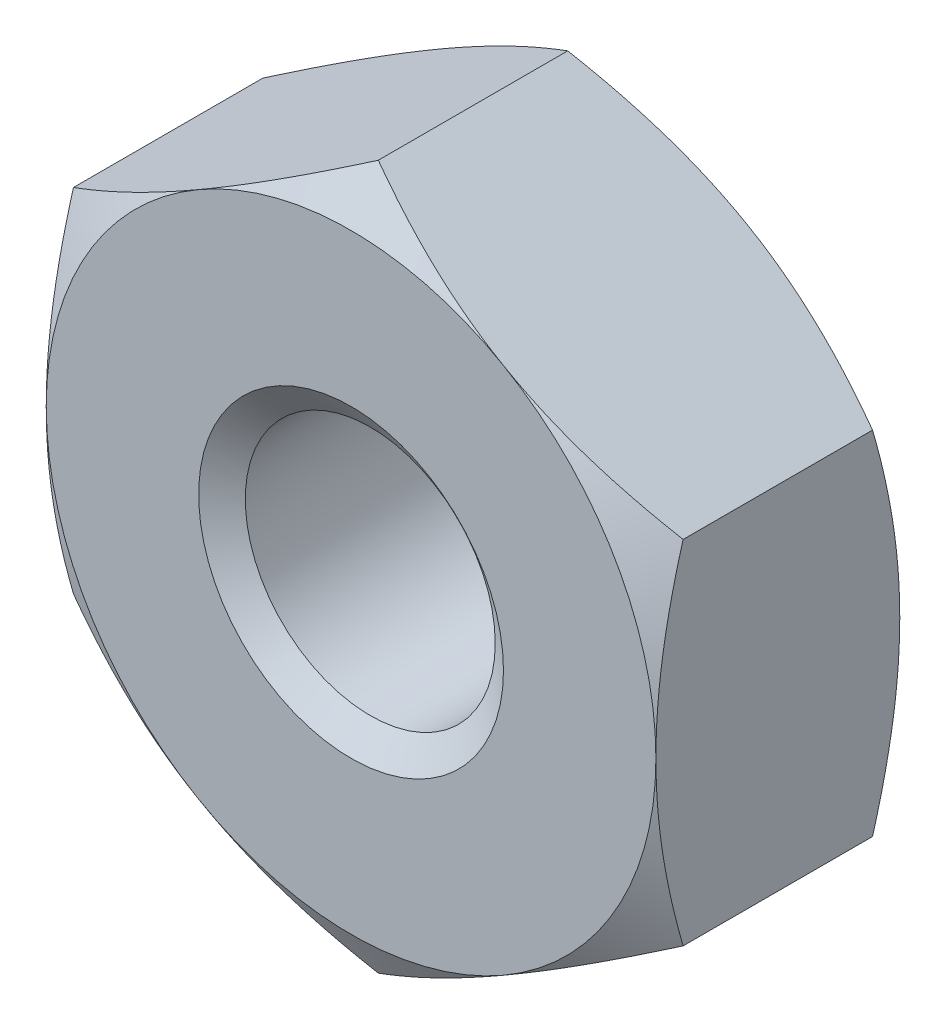
ISO-10303-21;
HEADER;
FILE_DESCRIPTION(('STEP AP214'),'2;1');
FILE_NAME('part.step','',(''),(''),'','','');
FILE_SCHEMA(('AUTOMOTIVE_DESIGN { 1 0 10303 214 1 1 1 1 }'));
ENDSEC;
DATA;
#1=APPLICATION_CONTEXT('core data for automotive mechanical design processes');
#2=APPLICATION_PROTOCOL_DEFINITION('international standard','automotive_design',2000,#1);
#3=PRODUCT_CONTEXT('',#1,'mechanical');
#4=PRODUCT('Part','Part','',(#3));
#5=PRODUCT_RELATED_PRODUCT_CATEGORY('part','',(#4));
#6=PRODUCT_DEFINITION_FORMATION('','',#4);
#7=PRODUCT_DEFINITION_CONTEXT('part definition',#1,'design');
#8=PRODUCT_DEFINITION('design','',#6,#7);
#9=PRODUCT_DEFINITION_SHAPE('','',#8);
#10=(LENGTH_UNIT() NAMED_UNIT(*) SI_UNIT(.MILLI.,.METRE.));
#11=(NAMED_UNIT(*) PLANE_ANGLE_UNIT() SI_UNIT($,.RADIAN.));
#12=(NAMED_UNIT(*) SI_UNIT($,.STERADIAN.) SOLID_ANGLE_UNIT());
#13=UNCERTAINTY_MEASURE_WITH_UNIT(LENGTH_MEASURE(1.E-05),#10,'distance_accuracy_value','');
#14=(GEOMETRIC_REPRESENTATION_CONTEXT(3) GLOBAL_UNCERTAINTY_ASSIGNED_CONTEXT((#13)) GLOBAL_UNIT_ASSIGNED_CONTEXT((#10,
#11,#12)) REPRESENTATION_CONTEXT('',''));
#15=CARTESIAN_POINT('',(0.,0.,0.));
#16=DIRECTION('',(0.,0.,1.));
#17=DIRECTION('',(1.,0.,0.));
#18=AXIS2_PLACEMENT_3D('',#15,#16,#17);
#19=CARTESIAN_POINT('',(0.,0.,-2.));
#20=DIRECTION('',(0.,0.,1.));
#21=DIRECTION('',(1.,0.,0.));
#22=AXIS2_PLACEMENT_3D('',#19,#20,#21);
#23=CYLINDRICAL_SURFACE('',#22,1.025);
#24=CARTESIAN_POINT('',(0.,0.,-0.157546696097181));
#25=DIRECTION('',(0.,0.,1.));
#26=DIRECTION('',(1.,0.,0.));
#27=AXIS2_PLACEMENT_3D('',#24,#25,#26);
#28=CIRCLE('',#27,1.025);
#29=CARTESIAN_POINT('',(1.025,0.,-0.157546696097181));
#30=VERTEX_POINT('',#29);
#31=EDGE_CURVE('E174',#30,#30,#28,.F.);
#32=ORIENTED_EDGE('',*,*,#31,.F.);
#33=EDGE_LOOP('',(#32));
#34=FACE_BOUND('',#33,.T.);
#35=CARTESIAN_POINT('',(0.,0.,-1.81705330390281));
#36=DIRECTION('',(0.,0.,-1.));
#37=DIRECTION('',(-1.,0.,0.));
#38=AXIS2_PLACEMENT_3D('',#35,#36,#37);
#39=CIRCLE('',#38,1.025);
#40=CARTESIAN_POINT('',(-1.025,0.,-1.81705330390281));
#41=VERTEX_POINT('',#40);
#42=EDGE_CURVE('E39',#41,#41,#39,.F.);
#43=ORIENTED_EDGE('',*,*,#42,.F.);
#44=EDGE_LOOP('',(#43));
#45=FACE_BOUND('',#44,.T.);
#46=ADVANCED_FACE('F34',(#34,#45),#23,.F.);
#47=CARTESIAN_POINT('',(0.,2.88675134594815,-2.));
#48=DIRECTION('',(0.,0.,-1.));
#49=DIRECTION('',(-1.,0.,0.));
#50=AXIS2_PLACEMENT_3D('',#47,#48,#49);
#51=PLANE('',#50);
#52=CARTESIAN_POINT('',(0.,0.,-2.));
#53=DIRECTION('',(0.,0.,-1.));
#54=DIRECTION('',(-1.,0.,0.));
#55=AXIS2_PLACEMENT_3D('',#52,#53,#54);
#56=CIRCLE('',#55,2.5);
#57=CARTESIAN_POINT('',(-2.5,0.,-2.));
#58=VERTEX_POINT('',#57);
#59=CARTESIAN_POINT('',(-1.24999999999998,-2.16506350946111,-2.));
#60=VERTEX_POINT('',#59);
#61=EDGE_CURVE('E170',#58,#60,#56,.F.);
#62=ORIENTED_EDGE('',*,*,#61,.F.);
#63=CARTESIAN_POINT('',(-1.25000000000003,2.16506350946108,-2.));
#64=VERTEX_POINT('',#63);
#65=EDGE_CURVE('E152',#64,#58,#56,.F.);
#66=ORIENTED_EDGE('',*,*,#65,.F.);
#67=CARTESIAN_POINT('',(1.25000000000002,2.16506350946108,-2.));
#68=VERTEX_POINT('',#67);
#69=EDGE_CURVE('E169',#68,#64,#56,.F.);
#70=ORIENTED_EDGE('',*,*,#69,.F.);
#71=CARTESIAN_POINT('',(0.,0.,-2.));
#72=DIRECTION('',(0.,0.,1.));
#73=DIRECTION('',(1.,0.,0.));
#74=AXIS2_PLACEMENT_3D('',#71,#72,#73);
#75=CIRCLE('',#74,2.5);
#76=CARTESIAN_POINT('',(2.5,0.,-2.));
#77=VERTEX_POINT('',#76);
#78=EDGE_CURVE('E248',#77,#68,#75,.T.);
#79=ORIENTED_EDGE('',*,*,#78,.F.);
#80=CARTESIAN_POINT('',(1.24999999999998,-2.1650635094611,-2.));
#81=VERTEX_POINT('',#80);
#82=EDGE_CURVE('E364',#81,#77,#56,.F.);
#83=ORIENTED_EDGE('',*,*,#82,.F.);
#84=EDGE_CURVE('E368',#60,#81,#56,.F.);
#85=ORIENTED_EDGE('',*,*,#84,.F.);
#86=EDGE_LOOP('',(#62,#66,#70,#79,#83,#85));
#87=FACE_BOUND('',#86,.T.);
#88=CARTESIAN_POINT('',(0.,0.,-2.));
#89=DIRECTION('',(0.,0.,-1.));
#90=DIRECTION('',(-1.,0.,0.));
#91=AXIS2_PLACEMENT_3D('',#88,#89,#90);
#92=CIRCLE('',#91,1.25);
#93=CARTESIAN_POINT('',(-1.25,0.,-2.));
#94=VERTEX_POINT('',#93);
#95=EDGE_CURVE('E178',#94,#94,#92,.F.);
#96=ORIENTED_EDGE('',*,*,#95,.T.);
#97=EDGE_LOOP('',(#96));
#98=FACE_BOUND('',#97,.T.);
#99=ADVANCED_FACE('F301',(#87,#98),#51,.T.);
#100=CARTESIAN_POINT('',(0.,2.88675134594815,0.));
#101=DIRECTION('',(0.,0.,-1.));
#102=DIRECTION('',(-1.,0.,0.));
#103=AXIS2_PLACEMENT_3D('',#100,#101,#102);
#104=PLANE('',#103);
#105=CARTESIAN_POINT('',(0.,0.,0.));
#106=DIRECTION('',(0.,0.,-1.));
#107=DIRECTION('',(-1.,0.,0.));
#108=AXIS2_PLACEMENT_3D('',#105,#106,#107);
#109=CIRCLE('',#108,2.49999999999999);
#110=CARTESIAN_POINT('',(-2.5,0.,0.));
#111=VERTEX_POINT('',#110);
#112=CARTESIAN_POINT('',(-1.25000000000003,2.16506350946108,0.));
#113=VERTEX_POINT('',#112);
#114=EDGE_CURVE('E11',#111,#113,#109,.T.);
#115=ORIENTED_EDGE('',*,*,#114,.F.);
#116=CARTESIAN_POINT('',(-1.24999999999998,-2.16506350946111,0.));
#117=VERTEX_POINT('',#116);
#118=EDGE_CURVE('E46',#117,#111,#109,.T.);
#119=ORIENTED_EDGE('',*,*,#118,.F.);
#120=CARTESIAN_POINT('',(1.24999999999998,-2.1650635094611,0.));
#121=VERTEX_POINT('',#120);
#122=EDGE_CURVE('E173',#121,#117,#109,.T.);
#123=ORIENTED_EDGE('',*,*,#122,.F.);
#124=CARTESIAN_POINT('',(2.5,0.,0.));
#125=VERTEX_POINT('',#124);
#126=EDGE_CURVE('E355',#125,#121,#109,.T.);
#127=ORIENTED_EDGE('',*,*,#126,.F.);
#128=CARTESIAN_POINT('',(0.,0.,0.));
#129=DIRECTION('',(0.,0.,1.));
#130=DIRECTION('',(1.,0.,0.));
#131=AXIS2_PLACEMENT_3D('',#128,#129,#130);
#132=CIRCLE('',#131,2.5);
#133=CARTESIAN_POINT('',(1.25000000000002,2.16506350946108,0.));
#134=VERTEX_POINT('',#133);
#135=EDGE_CURVE('E128',#125,#134,#132,.T.);
#136=ORIENTED_EDGE('',*,*,#135,.T.);
#137=EDGE_CURVE('E44',#113,#134,#109,.T.);
#138=ORIENTED_EDGE('',*,*,#137,.F.);
#139=EDGE_LOOP('',(#115,#119,#123,#127,#136,#138));
#140=FACE_BOUND('',#139,.T.);
#141=CARTESIAN_POINT('',(0.,0.,0.));
#142=DIRECTION('',(0.,0.,1.));
#143=DIRECTION('',(1.,0.,0.));
#144=AXIS2_PLACEMENT_3D('',#141,#142,#143);
#145=CIRCLE('',#144,1.25);
#146=CARTESIAN_POINT('',(1.25,0.,0.));
#147=VERTEX_POINT('',#146);
#148=EDGE_CURVE('E177',#147,#147,#145,.T.);
#149=ORIENTED_EDGE('',*,*,#148,.F.);
#150=EDGE_LOOP('',(#149));
#151=FACE_BOUND('',#150,.T.);
#152=ADVANCED_FACE('F253',(#140,#151),#104,.F.);
#153=CARTESIAN_POINT('',(0.,2.88675134594815,-2.));
#154=DIRECTION('',(-0.500000000000011,0.866025403784432,0.));
#155=DIRECTION('',(-0.866025403784432,-0.500000000000011,0.));
#156=AXIS2_PLACEMENT_3D('',#153,#154,#155);
#157=PLANE('',#156);
#158=DIRECTION('',(0.,0.,1.));
#159=VECTOR('',#158,1.);
#160=CARTESIAN_POINT('',(-2.5,1.44337567297404,-2.));
#161=LINE('',#160,#159);
#162=CARTESIAN_POINT('',(-2.5,1.44337567297411,-1.77670900630738));
#163=VERTEX_POINT('',#162);
#164=CARTESIAN_POINT('',(-2.5,1.44337567297404,-0.223290993692601));
#165=VERTEX_POINT('',#164);
#166=EDGE_CURVE('E164',#163,#165,#161,.T.);
#167=ORIENTED_EDGE('',*,*,#166,.T.);
#168=CARTESIAN_POINT('',(-2.5002,1.44326020292021,-0.223357664359107));
#169=CARTESIAN_POINT('',(-2.39033676526513,1.50668977106843,-0.186721620107625));
#170=CARTESIAN_POINT('',(-2.27952520010348,1.57066685804383,-0.153402218965056));
#171=CARTESIAN_POINT('',(-2.05598316653395,1.6997289113004,-0.0952422855578579));
#172=CARTESIAN_POINT('',(-1.94324872547162,1.76481617119468,-0.0704223291477388));
#173=CARTESIAN_POINT('',(-1.71917700612474,1.89418403867739,-0.0317856514410534));
#174=CARTESIAN_POINT('',(-1.60787420823263,1.95844473900196,-0.0177117961856408));
#175=CARTESIAN_POINT('',(-1.38474477253168,2.08726857876804,-0.000909152352753178));
#176=CARTESIAN_POINT('',(-1.27291894598578,2.15183124982666,0.00183354879636987));
#177=CARTESIAN_POINT('',(-1.06395802444849,2.27247489412633,-0.00386576000805812));
#178=CARTESIAN_POINT('',(-0.966791682442278,2.32857390783979,-0.010908394381867));
#179=CARTESIAN_POINT('',(-0.773092050289005,2.44040644260542,-0.0332314191249495));
#180=CARTESIAN_POINT('',(-0.676559430340275,2.4961395767184,-0.0485194384402751));
#181=CARTESIAN_POINT('',(-0.482460278259529,2.6082027744217,-0.0867390938444306));
#182=CARTESIAN_POINT('',(-0.384918318217864,2.66451865130904,-0.109832776125529));
#183=CARTESIAN_POINT('',(-0.191289391923917,2.77631036402775,-0.162246656577927));
#184=CARTESIAN_POINT('',(-0.0951999441138252,2.83178763258719,-0.191554535624564));
#185=CARTESIAN_POINT('',(0.000199999999999364,2.88686681600199,-0.223357664359126));
#186=B_SPLINE_CURVE_WITH_KNOTS('',3,(#168,#169,#170,#171,#172,#173,#174,#175,#176,#177,#178,
#179,#180,#181,#182,#183,#184,#185),.UNSPECIFIED.,.F.,.F.,(4,2,2,2,2,2,2,2,4),(0.,
0.396285827362226,0.793524330152049,1.18093086852114,1.56786160134475,1.90479741793733,
2.24204551660464,2.58677531536757,2.93082800105258),.UNSPECIFIED.);
#187=EDGE_CURVE('E133',#165,#113,#186,.T.);
#188=ORIENTED_EDGE('',*,*,#187,.T.);
#189=CARTESIAN_POINT('',(0.,2.88675134594815,-0.223290993692619));
#190=VERTEX_POINT('',#189);
#191=EDGE_CURVE('E53',#113,#190,#186,.T.);
#192=ORIENTED_EDGE('',*,*,#191,.T.);
#193=DIRECTION('',(0.,0.,1.));
#194=VECTOR('',#193,1.);
#195=CARTESIAN_POINT('',(0.,2.88675134594815,-2.));
#196=LINE('',#195,#194);
#197=CARTESIAN_POINT('',(0.,2.88675134594815,-1.77670900630738));
#198=VERTEX_POINT('',#197);
#199=EDGE_CURVE('E149',#198,#190,#196,.T.);
#200=ORIENTED_EDGE('',*,*,#199,.F.);
#201=CARTESIAN_POINT('',(-2.5002,1.44326020292021,-1.77664233564089));
#202=CARTESIAN_POINT('',(-2.39033676526513,1.50668977106843,-1.81327837989238));
#203=CARTESIAN_POINT('',(-2.27952520010348,1.57066685804383,-1.84659778103495));
#204=CARTESIAN_POINT('',(-2.05598316653395,1.6997289113004,-1.90475771444214));
#205=CARTESIAN_POINT('',(-1.94324872547162,1.76481617119468,-1.92957767085226));
#206=CARTESIAN_POINT('',(-1.71917700612474,1.89418403867739,-1.96821434855895));
#207=CARTESIAN_POINT('',(-1.60787420823263,1.95844473900196,-1.98228820381436));
#208=CARTESIAN_POINT('',(-1.38474477253168,2.08726857876804,-1.99909084764725));
#209=CARTESIAN_POINT('',(-1.27291894598578,2.15183124982666,-2.00183354879637));
#210=CARTESIAN_POINT('',(-1.06395802444849,2.27247489412633,-1.99613423999194));
#211=CARTESIAN_POINT('',(-0.966791682442278,2.32857390783979,-1.98909160561813));
#212=CARTESIAN_POINT('',(-0.773092050289005,2.44040644260542,-1.96676858087505));
#213=CARTESIAN_POINT('',(-0.676559430340275,2.4961395767184,-1.95148056155973));
#214=CARTESIAN_POINT('',(-0.482460278259529,2.6082027744217,-1.91326090615557));
#215=CARTESIAN_POINT('',(-0.384918318217864,2.66451865130904,-1.89016722387447));
#216=CARTESIAN_POINT('',(-0.191289391923917,2.77631036402775,-1.83775334342207));
#217=CARTESIAN_POINT('',(-0.0951999441138252,2.83178763258719,-1.80844546437544));
#218=CARTESIAN_POINT('',(0.000199999999999366,2.88686681600199,-1.77664233564088));
#219=B_SPLINE_CURVE_WITH_KNOTS('',3,(#201,#202,#203,#204,#205,#206,#207,#208,#209,#210,#211,
#212,#213,#214,#215,#216,#217,#218),.UNSPECIFIED.,.F.,.F.,(4,2,2,2,2,2,2,2,4),(0.,
0.396285827362226,0.793524330152049,1.18093086852114,1.56786160134475,1.90479741793733,
2.24204551660464,2.58677531536757,2.93082800105258),.UNSPECIFIED.);
#220=EDGE_CURVE('E167',#64,#198,#219,.T.);
#221=ORIENTED_EDGE('',*,*,#220,.F.);
#222=EDGE_CURVE('E263',#163,#64,#219,.T.);
#223=ORIENTED_EDGE('',*,*,#222,.F.);
#224=EDGE_LOOP('',(#167,#188,#192,#200,#221,#223));
#225=FACE_BOUND('',#224,.T.);
#226=ADVANCED_FACE('F36',(#225),#157,.T.);
#227=CARTESIAN_POINT('',(2.5,1.44337567297405,-2.));
#228=DIRECTION('',(0.50000000000001,0.866025403784433,0.));
#229=DIRECTION('',(-0.866025403784433,0.50000000000001,0.));
#230=AXIS2_PLACEMENT_3D('',#227,#228,#229);
#231=PLANE('',#230);
#232=ORIENTED_EDGE('',*,*,#199,.T.);
#233=CARTESIAN_POINT('',(-0.000200000000000814,2.88686681600199,-0.223357664359126));
#234=CARTESIAN_POINT('',(0.10966323473487,2.82343724785376,-0.186721620107642));
#235=CARTESIAN_POINT('',(0.220474799896525,2.75946016087836,-0.15340221896507));
#236=CARTESIAN_POINT('',(0.444016833466049,2.63039810762179,-0.0952422855578697));
#237=CARTESIAN_POINT('',(0.556751274528387,2.56531084772751,-0.0704223291477491));
#238=CARTESIAN_POINT('',(0.780822993875268,2.4359429802448,-0.0317856514410604));
#239=CARTESIAN_POINT('',(0.892125791767376,2.37168227992023,-0.0177117961856461));
#240=CARTESIAN_POINT('',(1.11525522746833,2.24285844015415,-0.000909152352755333));
#241=CARTESIAN_POINT('',(1.22708105401423,2.17829576909553,0.00183354879636898));
#242=CARTESIAN_POINT('',(1.43604197555152,2.05765212479585,-0.00386576000805646));
#243=CARTESIAN_POINT('',(1.53320831755773,2.0015531110824,-0.0109083943818638));
#244=CARTESIAN_POINT('',(1.726907949711,1.88972057631677,-0.0332314191249436));
#245=CARTESIAN_POINT('',(1.82344056965973,1.83398744220379,-0.0485194384402679));
#246=CARTESIAN_POINT('',(2.01753972174048,1.72192424450049,-0.0867390938444206));
#247=CARTESIAN_POINT('',(2.11508168178214,1.66560836761315,-0.109832776125517));
#248=CARTESIAN_POINT('',(2.30871060807608,1.55381665489444,-0.162246656577913));
#249=CARTESIAN_POINT('',(2.40480005588618,1.498339386335,-0.191554535624548));
#250=CARTESIAN_POINT('',(2.5002,1.44326020292021,-0.223357664359108));
#251=B_SPLINE_CURVE_WITH_KNOTS('',3,(#233,#234,#235,#236,#237,#238,#239,#240,#241,#242,#243,
#244,#245,#246,#247,#248,#249,#250),.UNSPECIFIED.,.F.,.F.,(4,2,2,2,2,2,2,2,4),(0.,
0.39628582736223,0.793524330152058,1.18093086852115,1.56786160134477,1.90479741793734,
2.24204551660464,2.58677531536758,2.93082800105258),.UNSPECIFIED.);
#252=EDGE_CURVE('E143',#190,#134,#251,.T.);
#253=ORIENTED_EDGE('',*,*,#252,.T.);
#254=CARTESIAN_POINT('',(2.5,1.44337567297411,-0.223290993692619));
#255=VERTEX_POINT('',#254);
#256=EDGE_CURVE('E60',#134,#255,#251,.T.);
#257=ORIENTED_EDGE('',*,*,#256,.T.);
#258=DIRECTION('',(0.,0.,1.));
#259=VECTOR('',#258,1.);
#260=CARTESIAN_POINT('',(2.5,1.44337567297405,-2.));
#261=LINE('',#260,#259);
#262=CARTESIAN_POINT('',(2.5,1.44337567297411,-1.77670900630738));
#263=VERTEX_POINT('',#262);
#264=EDGE_CURVE('E142',#263,#255,#261,.T.);
#265=ORIENTED_EDGE('',*,*,#264,.F.);
#266=CARTESIAN_POINT('',(-0.000200000000000814,2.88686681600199,-1.77664233564088));
#267=CARTESIAN_POINT('',(0.10966323473487,2.82343724785376,-1.81327837989236));
#268=CARTESIAN_POINT('',(0.220474799896525,2.75946016087836,-1.84659778103493));
#269=CARTESIAN_POINT('',(0.444016833466049,2.63039810762179,-1.90475771444213));
#270=CARTESIAN_POINT('',(0.556751274528387,2.56531084772751,-1.92957767085225));
#271=CARTESIAN_POINT('',(0.780822993875268,2.4359429802448,-1.96821434855894));
#272=CARTESIAN_POINT('',(0.892125791767376,2.37168227992023,-1.98228820381436));
#273=CARTESIAN_POINT('',(1.11525522746833,2.24285844015415,-1.99909084764725));
#274=CARTESIAN_POINT('',(1.22708105401423,2.17829576909553,-2.00183354879637));
#275=CARTESIAN_POINT('',(1.43604197555152,2.05765212479585,-1.99613423999195));
#276=CARTESIAN_POINT('',(1.53320831755773,2.0015531110824,-1.98909160561814));
#277=CARTESIAN_POINT('',(1.726907949711,1.88972057631677,-1.96676858087506));
#278=CARTESIAN_POINT('',(1.82344056965973,1.83398744220379,-1.95148056155973));
#279=CARTESIAN_POINT('',(2.01753972174047,1.72192424450049,-1.91326090615558));
#280=CARTESIAN_POINT('',(2.11508168178214,1.66560836761315,-1.89016722387448));
#281=CARTESIAN_POINT('',(2.30871060807608,1.55381665489444,-1.83775334342209));
#282=CARTESIAN_POINT('',(2.40480005588618,1.498339386335,-1.80844546437545));
#283=CARTESIAN_POINT('',(2.5002,1.44326020292021,-1.77664233564089));
#284=B_SPLINE_CURVE_WITH_KNOTS('',3,(#266,#267,#268,#269,#270,#271,#272,#273,#274,#275,#276,
#277,#278,#279,#280,#281,#282,#283),.UNSPECIFIED.,.F.,.F.,(4,2,2,2,2,2,2,2,4),(0.,
0.39628582736223,0.793524330152058,1.18093086852115,1.56786160134477,1.90479741793734,
2.24204551660464,2.58677531536758,2.93082800105258),.UNSPECIFIED.);
#285=EDGE_CURVE('E257',#68,#263,#284,.T.);
#286=ORIENTED_EDGE('',*,*,#285,.F.);
#287=EDGE_CURVE('E262',#198,#68,#284,.T.);
#288=ORIENTED_EDGE('',*,*,#287,.F.);
#289=EDGE_LOOP('',(#232,#253,#257,#265,#286,#288));
#290=FACE_BOUND('',#289,.T.);
#291=ADVANCED_FACE('F140',(#290),#231,.T.);
#292=CARTESIAN_POINT('',(2.5,1.44337567297405,-2.));
#293=DIRECTION('',(-1.,0.,0.));
#294=DIRECTION('',(0.,0.,1.));
#295=AXIS2_PLACEMENT_3D('',#292,#293,#294);
#296=PLANE('',#295);
#297=CARTESIAN_POINT('',(2.5,-3.82804499372436,-1.19631676327542));
#298=CARTESIAN_POINT('',(2.5,-3.71828085649176,-1.14327266922934));
#299=CARTESIAN_POINT('',(2.5,-3.60825720059557,-1.09075587737965));
#300=CARTESIAN_POINT('',(2.5,-3.38755052986225,-0.987078216748249));
#301=CARTESIAN_POINT('',(2.5,-3.27686740487458,-0.935917582729541));
#302=CARTESIAN_POINT('',(2.5,-3.05410357303962,-0.834984039411619));
#303=CARTESIAN_POINT('',(2.5,-2.94201849305855,-0.785220746914419));
#304=CARTESIAN_POINT('',(2.5,-2.71692709217043,-0.687831615887705));
#305=CARTESIAN_POINT('',(2.5,-2.60392081964714,-0.640205665942532));
#306=CARTESIAN_POINT('',(2.5,-2.37540441715614,-0.547094156496494));
#307=CARTESIAN_POINT('',(2.5,-2.25988058014234,-0.501642052634921));
#308=CARTESIAN_POINT('',(2.5,-2.02747029246858,-0.414297644349653));
#309=CARTESIAN_POINT('',(2.5,-1.91058369184879,-0.37240573597908));
#310=CARTESIAN_POINT('',(2.5,-1.67550198908609,-0.293307342769315));
#311=CARTESIAN_POINT('',(2.5,-1.55731027320533,-0.256090896739911));
#312=CARTESIAN_POINT('',(2.5,-1.3192465914741,-0.187552097840328));
#313=CARTESIAN_POINT('',(2.5,-1.19937516991096,-0.156227881047981));
#314=CARTESIAN_POINT('',(2.5,-0.957870204363777,-0.100994246846285));
#315=CARTESIAN_POINT('',(2.5,-0.836236200197837,-0.0770868037228461));
#316=CARTESIAN_POINT('',(2.5,-0.591501703670372,-0.0382963974514716));
#317=CARTESIAN_POINT('',(2.5,-0.468401210012384,-0.023413442282318));
#318=CARTESIAN_POINT('',(2.5,-0.222157493517489,-0.00398863321840235));
#319=CARTESIAN_POINT('',(2.5,-0.0990195694337815,0.00061868797564693));
#320=CARTESIAN_POINT('',(2.5,0.147170053504644,-0.000752541484249824));
#321=CARTESIAN_POINT('',(2.5,0.270221766445105,-0.00672834425959618));
#322=CARTESIAN_POINT('',(2.5,0.480350397015924,-0.0255492091334953));
#323=CARTESIAN_POINT('',(2.5,0.567659136488612,-0.0359433100274442));
#324=CARTESIAN_POINT('',(2.5,0.741602181646831,-0.0613833814666819));
#325=CARTESIAN_POINT('',(2.5,0.828236378756305,-0.0764300856615279));
#326=CARTESIAN_POINT('',(2.5,1.08705653408103,-0.127759419343891));
#327=CARTESIAN_POINT('',(2.5,1.25802931580448,-0.170218054015717));
#328=CARTESIAN_POINT('',(2.5,1.51386408134074,-0.243447724573246));
#329=CARTESIAN_POINT('',(2.5,1.60005960225958,-0.269821213632266));
#330=CARTESIAN_POINT('',(2.5,1.77155099438373,-0.325177862642344));
#331=CARTESIAN_POINT('',(2.5,1.85684744139719,-0.354159222616812));
#332=CARTESIAN_POINT('',(2.5,2.02618400322709,-0.41412856198767));
#333=CARTESIAN_POINT('',(2.5,2.1102284871677,-0.445104328595928));
#334=CARTESIAN_POINT('',(2.5,2.27766538220567,-0.508873971119178));
#335=CARTESIAN_POINT('',(2.5,2.36105751399613,-0.541668581852094));
#336=CARTESIAN_POINT('',(2.5,2.44414811866673,-0.575193129088608));
#337=B_SPLINE_CURVE_WITH_KNOTS('',3,(#297,#298,#299,#300,#301,#302,#303,#304,#305,#306,#307,
#308,#309,#310,#311,#312,#313,#314,#315,#316,#317,#318,#319,#320,#321,#322,#323,#324,#325,#326,
#327,#328,#329,#330,#331,#332,#333,#334,#335,#336),.UNSPECIFIED.,.F.,.F.,(4,2,2,2,2,2,2,2,2,2,2,
2,2,2,2,2,2,2,2,4),(0.,0.365732370332671,0.731527644124544,1.09941621653744,1.46728558928017,
1.83967125623428,2.21209829506681,2.58371790436001,2.9552197586967,3.32682041917404,
3.69842140819259,4.06764803658774,4.43677881037431,4.70042588015952,4.96411454456776,
5.49188432099894,5.76228301186056,6.03249648197686,6.30118900914356,6.56999089095292),.UNSPECIFIED.);
#338=CARTESIAN_POINT('',(2.50000000000001,-1.44337567297409,-0.223290993692619));
#339=VERTEX_POINT('',#338);
#340=EDGE_CURVE('E135',#339,#125,#337,.T.);
#341=ORIENTED_EDGE('',*,*,#340,.F.);
#342=DIRECTION('',(0.,0.,1.));
#343=VECTOR('',#342,1.);
#344=CARTESIAN_POINT('',(2.5,-1.4433756729741,-2.));
#345=LINE('',#344,#343);
#346=CARTESIAN_POINT('',(2.50000000000001,-1.44337567297409,-1.77670900630738));
#347=VERTEX_POINT('',#346);
#348=EDGE_CURVE('E150',#347,#339,#345,.T.);
#349=ORIENTED_EDGE('',*,*,#348,.F.);
#350=CARTESIAN_POINT('',(2.5,-3.82804499372436,-0.803683236724578));
#351=CARTESIAN_POINT('',(2.5,-3.71828085649176,-0.856727330770667));
#352=CARTESIAN_POINT('',(2.5,-3.60825720059557,-0.909244122620355));
#353=CARTESIAN_POINT('',(2.5,-3.38755052986225,-1.01292178325175));
#354=CARTESIAN_POINT('',(2.5,-3.27686740487458,-1.06408241727046));
#355=CARTESIAN_POINT('',(2.5,-3.05410357303962,-1.16501596058838));
#356=CARTESIAN_POINT('',(2.5,-2.94201849305855,-1.21477925308558));
#357=CARTESIAN_POINT('',(2.5,-2.71692709217043,-1.3121683841123));
#358=CARTESIAN_POINT('',(2.5,-2.60392081964714,-1.35979433405747));
#359=CARTESIAN_POINT('',(2.5,-2.37540441715614,-1.45290584350351));
#360=CARTESIAN_POINT('',(2.5,-2.25988058014234,-1.49835794736508));
#361=CARTESIAN_POINT('',(2.5,-2.02747029246858,-1.58570235565035));
#362=CARTESIAN_POINT('',(2.5,-1.91058369184879,-1.62759426402092));
#363=CARTESIAN_POINT('',(2.5,-1.67550198908609,-1.70669265723069));
#364=CARTESIAN_POINT('',(2.5,-1.55731027320533,-1.74390910326009));
#365=CARTESIAN_POINT('',(2.5,-1.3192465914741,-1.81244790215967));
#366=CARTESIAN_POINT('',(2.5,-1.19937516991096,-1.84377211895202));
#367=CARTESIAN_POINT('',(2.5,-0.957870204363777,-1.89900575315372));
#368=CARTESIAN_POINT('',(2.5,-0.836236200197837,-1.92291319627716));
#369=CARTESIAN_POINT('',(2.5,-0.591501703670372,-1.96170360254853));
#370=CARTESIAN_POINT('',(2.5,-0.468401210012384,-1.97658655771768));
#371=CARTESIAN_POINT('',(2.5,-0.222157493517489,-1.9960113667816));
#372=CARTESIAN_POINT('',(2.5,-0.0990195694337816,-2.00061868797565));
#373=CARTESIAN_POINT('',(2.5,0.147170053504644,-1.99924745851575));
#374=CARTESIAN_POINT('',(2.5,0.270221766445105,-1.99327165574041));
#375=CARTESIAN_POINT('',(2.5,0.480350397015924,-1.97445079086651));
#376=CARTESIAN_POINT('',(2.5,0.567659136488612,-1.96405668997256));
#377=CARTESIAN_POINT('',(2.5,0.741602181646831,-1.93861661853332));
#378=CARTESIAN_POINT('',(2.5,0.828236378756305,-1.92356991433847));
#379=CARTESIAN_POINT('',(2.5,1.08705653408103,-1.87224058065611));
#380=CARTESIAN_POINT('',(2.5,1.25802931580448,-1.82978194598428));
#381=CARTESIAN_POINT('',(2.5,1.51386408134074,-1.75655227542676));
#382=CARTESIAN_POINT('',(2.5,1.60005960225958,-1.73017878636774));
#383=CARTESIAN_POINT('',(2.5,1.77155099438374,-1.67482213735766));
#384=CARTESIAN_POINT('',(2.5,1.8568474413972,-1.64584077738319));
#385=CARTESIAN_POINT('',(2.5,2.02618400322709,-1.58587143801233));
#386=CARTESIAN_POINT('',(2.5,2.1102284871677,-1.55489567140407));
#387=CARTESIAN_POINT('',(2.5,2.27766538220567,-1.49112602888082));
#388=CARTESIAN_POINT('',(2.5,2.36105751399613,-1.45833141814791));
#389=CARTESIAN_POINT('',(2.5,2.44414811866673,-1.42480687091139));
#390=B_SPLINE_CURVE_WITH_KNOTS('',3,(#350,#351,#352,#353,#354,#355,#356,#357,#358,#359,#360,
#361,#362,#363,#364,#365,#366,#367,#368,#369,#370,#371,#372,#373,#374,#375,#376,#377,#378,#379,
#380,#381,#382,#383,#384,#385,#386,#387,#388,#389),.UNSPECIFIED.,.F.,.F.,(4,2,2,2,2,2,2,2,2,2,2,
2,2,2,2,2,2,2,2,4),(0.,0.36573237033267,0.731527644124545,1.09941621653744,1.46728558928017,
1.83967125623428,2.21209829506681,2.58371790436001,2.9552197586967,3.32682041917404,
3.69842140819259,4.06764803658774,4.43677881037431,4.70042588015952,4.96411454456776,
5.49188432099894,5.76228301186056,6.03249648197686,6.30118900914356,6.56999089095292),.UNSPECIFIED.);
#391=EDGE_CURVE('E269',#347,#77,#390,.T.);
#392=ORIENTED_EDGE('',*,*,#391,.T.);
#393=EDGE_CURVE('E148',#77,#263,#390,.T.);
#394=ORIENTED_EDGE('',*,*,#393,.T.);
#395=ORIENTED_EDGE('',*,*,#264,.T.);
#396=EDGE_CURVE('E125',#125,#255,#337,.T.);
#397=ORIENTED_EDGE('',*,*,#396,.F.);
#398=EDGE_LOOP('',(#341,#349,#392,#394,#395,#397));
#399=FACE_BOUND('',#398,.T.);
#400=ADVANCED_FACE('F146',(#399),#296,.F.);
#401=CARTESIAN_POINT('',(0.,-2.88675134594814,-2.));
#402=DIRECTION('',(0.499999999999994,-0.866025403784443,0.));
#403=DIRECTION('',(0.866025403784442,0.499999999999993,0.));
#404=AXIS2_PLACEMENT_3D('',#401,#402,#403);
#405=PLANE('',#404);
#406=ORIENTED_EDGE('',*,*,#348,.T.);
#407=CARTESIAN_POINT('',(2.5002,-1.44326020292026,-0.223357664359123));
#408=CARTESIAN_POINT('',(2.39033676526513,-1.50668977106848,-0.18672162010764));
#409=CARTESIAN_POINT('',(2.27952520010347,-1.57066685804388,-0.15340221896507));
#410=CARTESIAN_POINT('',(2.05598316653394,-1.69972891130044,-0.0952422855578713));
#411=CARTESIAN_POINT('',(1.9432487254716,-1.76481617119473,-0.0704223291477518));
#412=CARTESIAN_POINT('',(1.71917700612472,-1.89418403867743,-0.0317856514410653));
#413=CARTESIAN_POINT('',(1.60787420823261,-1.958444739002,-0.017711796185652));
#414=CARTESIAN_POINT('',(1.38474477253165,-2.08726857876807,-0.000909152352763485));
#415=CARTESIAN_POINT('',(1.27291894598576,-2.1518312498267,0.00183354879635976));
#416=CARTESIAN_POINT('',(1.06395802444847,-2.27247489412636,-0.00386576000806758));
#417=CARTESIAN_POINT('',(0.966791682442256,-2.32857390783982,-0.0109083943818756));
#418=CARTESIAN_POINT('',(0.773092050288987,-2.44040644260544,-0.0332314191249561));
#419=CARTESIAN_POINT('',(0.676559430340259,-2.49613957671841,-0.0485194384402806));
#420=CARTESIAN_POINT('',(0.482460278259517,-2.60820277442171,-0.0867390938444331));
#421=CARTESIAN_POINT('',(0.384918318217854,-2.66451865130904,-0.109832776125529));
#422=CARTESIAN_POINT('',(0.191289391923912,-2.77631036402775,-0.162246656577924));
#423=CARTESIAN_POINT('',(0.0951999441138222,-2.83178763258718,-0.191554535624559));
#424=CARTESIAN_POINT('',(-0.000200000000000178,-2.88686681600197,-0.223357664359118));
#425=B_SPLINE_CURVE_WITH_KNOTS('',3,(#407,#408,#409,#410,#411,#412,#413,#414,#415,#416,#417,
#418,#419,#420,#421,#422,#423,#424),.UNSPECIFIED.,.F.,.F.,(4,2,2,2,2,2,2,2,4),(0.,
0.396285827362229,0.793524330152056,1.18093086852115,1.56786160134476,1.90479741793733,
2.24204551660463,2.58677531536755,2.93082800105255),.UNSPECIFIED.);
#426=EDGE_CURVE('E350',#339,#121,#425,.T.);
#427=ORIENTED_EDGE('',*,*,#426,.T.);
#428=CARTESIAN_POINT('',(0.,-2.88675134594815,-0.223290993692619));
#429=VERTEX_POINT('',#428);
#430=EDGE_CURVE('E229',#121,#429,#425,.T.);
#431=ORIENTED_EDGE('',*,*,#430,.T.);
#432=DIRECTION('',(0.,0.,1.));
#433=VECTOR('',#432,1.);
#434=CARTESIAN_POINT('',(0.,-2.88675134594814,-2.));
#435=LINE('',#434,#433);
#436=CARTESIAN_POINT('',(0.,-2.88675134594815,-1.77670900630738));
#437=VERTEX_POINT('',#436);
#438=EDGE_CURVE('E155',#437,#429,#435,.T.);
#439=ORIENTED_EDGE('',*,*,#438,.F.);
#440=CARTESIAN_POINT('',(2.5002,-1.44326020292026,-1.77664233564088));
#441=CARTESIAN_POINT('',(2.39033676526513,-1.50668977106848,-1.81327837989236));
#442=CARTESIAN_POINT('',(2.27952520010347,-1.57066685804388,-1.84659778103493));
#443=CARTESIAN_POINT('',(2.05598316653394,-1.69972891130044,-1.90475771444213));
#444=CARTESIAN_POINT('',(1.9432487254716,-1.76481617119473,-1.92957767085225));
#445=CARTESIAN_POINT('',(1.71917700612472,-1.89418403867743,-1.96821434855894));
#446=CARTESIAN_POINT('',(1.60787420823261,-1.958444739002,-1.98228820381435));
#447=CARTESIAN_POINT('',(1.38474477253165,-2.08726857876807,-1.99909084764724));
#448=CARTESIAN_POINT('',(1.27291894598576,-2.1518312498267,-2.00183354879636));
#449=CARTESIAN_POINT('',(1.06395802444847,-2.27247489412636,-1.99613423999193));
#450=CARTESIAN_POINT('',(0.966791682442256,-2.32857390783982,-1.98909160561813));
#451=CARTESIAN_POINT('',(0.773092050288987,-2.44040644260544,-1.96676858087505));
#452=CARTESIAN_POINT('',(0.676559430340259,-2.49613957671841,-1.95148056155972));
#453=CARTESIAN_POINT('',(0.482460278259517,-2.60820277442171,-1.91326090615557));
#454=CARTESIAN_POINT('',(0.384918318217854,-2.66451865130904,-1.89016722387447));
#455=CARTESIAN_POINT('',(0.191289391923912,-2.77631036402775,-1.83775334342208));
#456=CARTESIAN_POINT('',(0.0951999441138224,-2.83178763258718,-1.80844546437544));
#457=CARTESIAN_POINT('',(-0.000200000000000179,-2.88686681600197,-1.77664233564088));
#458=B_SPLINE_CURVE_WITH_KNOTS('',3,(#440,#441,#442,#443,#444,#445,#446,#447,#448,#449,#450,
#451,#452,#453,#454,#455,#456,#457),.UNSPECIFIED.,.F.,.F.,(4,2,2,2,2,2,2,2,4),(0.,
0.396285827362229,0.793524330152056,1.18093086852115,1.56786160134476,1.90479741793733,
2.24204551660463,2.58677531536755,2.93082800105255),.UNSPECIFIED.);
#459=EDGE_CURVE('E275',#81,#437,#458,.T.);
#460=ORIENTED_EDGE('',*,*,#459,.F.);
#461=EDGE_CURVE('E274',#347,#81,#458,.T.);
#462=ORIENTED_EDGE('',*,*,#461,.F.);
#463=EDGE_LOOP('',(#406,#427,#431,#439,#460,#462));
#464=FACE_BOUND('',#463,.T.);
#465=ADVANCED_FACE('F285',(#464),#405,.T.);
#466=CARTESIAN_POINT('',(-2.5,-1.4433756729741,-2.));
#467=DIRECTION('',(-0.499999999999992,-0.866025403784443,0.));
#468=DIRECTION('',(0.866025403784443,-0.499999999999992,0.));
#469=AXIS2_PLACEMENT_3D('',#466,#467,#468);
#470=PLANE('',#469);
#471=ORIENTED_EDGE('',*,*,#438,.T.);
#472=CARTESIAN_POINT('',(0.000199999999999525,-2.88686681600197,-0.223357664359118));
#473=CARTESIAN_POINT('',(-0.109663234734873,-2.82343724785375,-0.186721620107636));
#474=CARTESIAN_POINT('',(-0.220474799896528,-2.75946016087835,-0.153402218965066));
#475=CARTESIAN_POINT('',(-0.444016833466055,-2.63039810762179,-0.0952422855578686));
#476=CARTESIAN_POINT('',(-0.556751274528394,-2.56531084772751,-0.0704223291477494));
#477=CARTESIAN_POINT('',(-0.780822993875277,-2.43594298024481,-0.0317856514410642));
#478=CARTESIAN_POINT('',(-0.892125791767386,-2.37168227992024,-0.0177117961856518));
#479=CARTESIAN_POINT('',(-1.11525522746835,-2.24285844015416,-0.000909152352764598));
#480=CARTESIAN_POINT('',(-1.22708105401424,-2.17829576909554,0.0018335487963582));
#481=CARTESIAN_POINT('',(-1.43604197555153,-2.05765212479588,-0.0038657600080702));
#482=CARTESIAN_POINT('',(-1.53320831755774,-2.00155311108242,-0.0109083943818788));
#483=CARTESIAN_POINT('',(-1.72690794971101,-1.8897205763168,-0.0332314191249604));
#484=CARTESIAN_POINT('',(-1.82344056965974,-1.83398744220382,-0.0485194384402852));
#485=CARTESIAN_POINT('',(-2.01753972174048,-1.72192424450053,-0.0867390938444385));
#486=CARTESIAN_POINT('',(-2.11508168178214,-1.6656083676132,-0.109832776125535));
#487=CARTESIAN_POINT('',(-2.30871060807609,-1.55381665489449,-0.162246656577931));
#488=CARTESIAN_POINT('',(-2.40480005588618,-1.49833938633506,-0.191554535624566));
#489=CARTESIAN_POINT('',(-2.5002,-1.44326020292027,-0.223357664359125));
#490=B_SPLINE_CURVE_WITH_KNOTS('',3,(#472,#473,#474,#475,#476,#477,#478,#479,#480,#481,#482,
#483,#484,#485,#486,#487,#488,#489),.UNSPECIFIED.,.F.,.F.,(4,2,2,2,2,2,2,2,4),(0.,
0.396285827362228,0.793524330152054,1.18093086852114,1.56786160134476,1.90479741793733,
2.24204551660462,2.58677531536755,2.93082800105255),.UNSPECIFIED.);
#491=EDGE_CURVE('E348',#429,#117,#490,.T.);
#492=ORIENTED_EDGE('',*,*,#491,.T.);
#493=CARTESIAN_POINT('',(-2.5,-1.44337567297411,-0.223290993692619));
#494=VERTEX_POINT('',#493);
#495=EDGE_CURVE('E203',#117,#494,#490,.T.);
#496=ORIENTED_EDGE('',*,*,#495,.T.);
#497=DIRECTION('',(0.,0.,1.));
#498=VECTOR('',#497,1.);
#499=CARTESIAN_POINT('',(-2.5,-1.4433756729741,-2.));
#500=LINE('',#499,#498);
#501=CARTESIAN_POINT('',(-2.5,-1.44337567297411,-1.77670900630738));
#502=VERTEX_POINT('',#501);
#503=EDGE_CURVE('E161',#502,#494,#500,.T.);
#504=ORIENTED_EDGE('',*,*,#503,.F.);
#505=CARTESIAN_POINT('',(0.000199999999999503,-2.88686681600197,-1.77664233564088));
#506=CARTESIAN_POINT('',(-0.109663234734873,-2.82343724785375,-1.81327837989237));
#507=CARTESIAN_POINT('',(-0.220474799896529,-2.75946016087835,-1.84659778103494));
#508=CARTESIAN_POINT('',(-0.444016833466055,-2.63039810762179,-1.90475771444213));
#509=CARTESIAN_POINT('',(-0.556751274528394,-2.56531084772751,-1.92957767085225));
#510=CARTESIAN_POINT('',(-0.780822993875277,-2.43594298024481,-1.96821434855894));
#511=CARTESIAN_POINT('',(-0.892125791767386,-2.37168227992024,-1.98228820381435));
#512=CARTESIAN_POINT('',(-1.11525522746835,-2.24285844015416,-1.99909084764724));
#513=CARTESIAN_POINT('',(-1.22708105401424,-2.17829576909554,-2.00183354879636));
#514=CARTESIAN_POINT('',(-1.43604197555153,-2.05765212479588,-1.99613423999193));
#515=CARTESIAN_POINT('',(-1.53320831755774,-2.00155311108242,-1.98909160561812));
#516=CARTESIAN_POINT('',(-1.72690794971101,-1.8897205763168,-1.96676858087504));
#517=CARTESIAN_POINT('',(-1.82344056965974,-1.83398744220382,-1.95148056155972));
#518=CARTESIAN_POINT('',(-2.01753972174048,-1.72192424450053,-1.91326090615556));
#519=CARTESIAN_POINT('',(-2.11508168178214,-1.6656083676132,-1.89016722387447));
#520=CARTESIAN_POINT('',(-2.30871060807609,-1.55381665489449,-1.83775334342207));
#521=CARTESIAN_POINT('',(-2.40480005588618,-1.49833938633506,-1.80844546437544));
#522=CARTESIAN_POINT('',(-2.5002,-1.44326020292027,-1.77664233564088));
#523=B_SPLINE_CURVE_WITH_KNOTS('',3,(#505,#506,#507,#508,#509,#510,#511,#512,#513,#514,#515,
#516,#517,#518,#519,#520,#521,#522),.UNSPECIFIED.,.F.,.F.,(4,2,2,2,2,2,2,2,4),(0.,
0.396285827362229,0.793524330152054,1.18093086852114,1.56786160134476,1.90479741793733,
2.24204551660462,2.58677531536755,2.93082800105255),.UNSPECIFIED.);
#524=EDGE_CURVE('E281',#60,#502,#523,.T.);
#525=ORIENTED_EDGE('',*,*,#524,.F.);
#526=EDGE_CURVE('E280',#437,#60,#523,.T.);
#527=ORIENTED_EDGE('',*,*,#526,.F.);
#528=EDGE_LOOP('',(#471,#492,#496,#504,#525,#527));
#529=FACE_BOUND('',#528,.T.);
#530=ADVANCED_FACE('F288',(#529),#470,.T.);
#531=CARTESIAN_POINT('',(-2.5,1.44337567297404,-2.));
#532=DIRECTION('',(-1.,0.,0.));
#533=DIRECTION('',(0.,0.,1.));
#534=AXIS2_PLACEMENT_3D('',#531,#532,#533);
#535=PLANE('',#534);
#536=ORIENTED_EDGE('',*,*,#503,.T.);
#537=CARTESIAN_POINT('',(-2.5,-3.82804499372437,-1.19631676327543));
#538=CARTESIAN_POINT('',(-2.5,-3.71828085649177,-1.14327266922934));
#539=CARTESIAN_POINT('',(-2.5,-3.60825720059558,-1.09075587737965));
#540=CARTESIAN_POINT('',(-2.5,-3.38755052986226,-0.987078216748253));
#541=CARTESIAN_POINT('',(-2.5,-3.27686740487459,-0.935917582729545));
#542=CARTESIAN_POINT('',(-2.5,-3.05410357303963,-0.834984039411622));
#543=CARTESIAN_POINT('',(-2.5,-2.94201849305855,-0.785220746914422));
#544=CARTESIAN_POINT('',(-2.5,-2.71692709217043,-0.687831615887708));
#545=CARTESIAN_POINT('',(-2.5,-2.60392081964715,-0.640205665942535));
#546=CARTESIAN_POINT('',(-2.5,-2.37540441715615,-0.547094156496497));
#547=CARTESIAN_POINT('',(-2.5,-2.25988058014235,-0.501642052634923));
#548=CARTESIAN_POINT('',(-2.5,-2.02747029246859,-0.414297644349656));
#549=CARTESIAN_POINT('',(-2.5,-1.91058369184879,-0.372405735979083));
#550=CARTESIAN_POINT('',(-2.5,-1.6755019890861,-0.293307342769317));
#551=CARTESIAN_POINT('',(-2.5,-1.55731027320534,-0.256090896739914));
#552=CARTESIAN_POINT('',(-2.5,-1.3192465914741,-0.18755209784033));
#553=CARTESIAN_POINT('',(-2.5,-1.19937516991096,-0.156227881047983));
#554=CARTESIAN_POINT('',(-2.5,-0.957870204363783,-0.100994246846287));
#555=CARTESIAN_POINT('',(-2.5,-0.836236200197844,-0.0770868037228473));
#556=CARTESIAN_POINT('',(-2.5,-0.591501703670378,-0.0382963974514724));
#557=CARTESIAN_POINT('',(-2.5,-0.46840121001239,-0.0234134422823187));
#558=CARTESIAN_POINT('',(-2.5,-0.222157493517495,-0.00398863321840267));
#559=CARTESIAN_POINT('',(-2.5,-0.099019569433787,0.000618687975646825));
#560=CARTESIAN_POINT('',(-2.5,0.147170053504639,-0.000752541484249718));
#561=CARTESIAN_POINT('',(-2.5,0.2702217664451,-0.00672834425959606));
#562=CARTESIAN_POINT('',(-2.5,0.480350397015919,-0.0255492091334949));
#563=CARTESIAN_POINT('',(-2.5,0.567659136488607,-0.0359433100274436));
#564=CARTESIAN_POINT('',(-2.5,0.741602181646824,-0.061383381466681));
#565=CARTESIAN_POINT('',(-2.5,0.828236378756298,-0.0764300856615268));
#566=CARTESIAN_POINT('',(-2.5,1.08705653408102,-0.12775941934389));
#567=CARTESIAN_POINT('',(-2.5,1.25802931580447,-0.170218054015715));
#568=CARTESIAN_POINT('',(-2.5,1.51386408134073,-0.243447724573244));
#569=CARTESIAN_POINT('',(-2.5,1.60005960225957,-0.269821213632264));
#570=CARTESIAN_POINT('',(-2.5,1.77155099438373,-0.325177862642341));
#571=CARTESIAN_POINT('',(-2.5,1.85684744139719,-0.354159222616809));
#572=CARTESIAN_POINT('',(-2.5,2.02618400322708,-0.414128561987666));
#573=CARTESIAN_POINT('',(-2.5,2.11022848716769,-0.445104328595924));
#574=CARTESIAN_POINT('',(-2.5,2.27766538220566,-0.508873971119174));
#575=CARTESIAN_POINT('',(-2.5,2.36105751399612,-0.54166858185209));
#576=CARTESIAN_POINT('',(-2.5,2.44414811866672,-0.575193129088605));
#577=B_SPLINE_CURVE_WITH_KNOTS('',3,(#537,#538,#539,#540,#541,#542,#543,#544,#545,#546,#547,
#548,#549,#550,#551,#552,#553,#554,#555,#556,#557,#558,#559,#560,#561,#562,#563,#564,#565,#566,
#567,#568,#569,#570,#571,#572,#573,#574,#575,#576),.UNSPECIFIED.,.F.,.F.,(4,2,2,2,2,2,2,2,2,2,2,
2,2,2,2,2,2,2,2,4),(0.,0.365732370332671,0.731527644124545,1.09941621653744,1.46728558928017,
1.83967125623428,2.21209829506681,2.58371790436001,2.95521975869671,3.32682041917405,
3.6984214081926,4.06764803658775,4.43677881037431,4.70042588015952,4.96411454456776,
5.49188432099894,5.76228301186056,6.03249648197686,6.30118900914356,6.56999089095292),.UNSPECIFIED.);
#578=EDGE_CURVE('E202',#494,#111,#577,.T.);
#579=ORIENTED_EDGE('',*,*,#578,.T.);
#580=EDGE_CURVE('E195',#111,#165,#577,.T.);
#581=ORIENTED_EDGE('',*,*,#580,.T.);
#582=ORIENTED_EDGE('',*,*,#166,.F.);
#583=CARTESIAN_POINT('',(-2.5,-3.82804499372437,-0.803683236724574));
#584=CARTESIAN_POINT('',(-2.5,-3.71828085649177,-0.856727330770663));
#585=CARTESIAN_POINT('',(-2.5,-3.60825720059558,-0.909244122620352));
#586=CARTESIAN_POINT('',(-2.5,-3.38755052986226,-1.01292178325175));
#587=CARTESIAN_POINT('',(-2.5,-3.27686740487459,-1.06408241727046));
#588=CARTESIAN_POINT('',(-2.5,-3.05410357303963,-1.16501596058838));
#589=CARTESIAN_POINT('',(-2.5,-2.94201849305855,-1.21477925308558));
#590=CARTESIAN_POINT('',(-2.5,-2.71692709217044,-1.31216838411229));
#591=CARTESIAN_POINT('',(-2.5,-2.60392081964715,-1.35979433405747));
#592=CARTESIAN_POINT('',(-2.5,-2.37540441715615,-1.4529058435035));
#593=CARTESIAN_POINT('',(-2.5,-2.25988058014235,-1.49835794736508));
#594=CARTESIAN_POINT('',(-2.5,-2.02747029246859,-1.58570235565035));
#595=CARTESIAN_POINT('',(-2.5,-1.9105836918488,-1.62759426402092));
#596=CARTESIAN_POINT('',(-2.5,-1.6755019890861,-1.70669265723068));
#597=CARTESIAN_POINT('',(-2.5,-1.55731027320534,-1.74390910326009));
#598=CARTESIAN_POINT('',(-2.5,-1.3192465914741,-1.81244790215967));
#599=CARTESIAN_POINT('',(-2.5,-1.19937516991096,-1.84377211895202));
#600=CARTESIAN_POINT('',(-2.5,-0.957870204363783,-1.89900575315372));
#601=CARTESIAN_POINT('',(-2.5,-0.836236200197843,-1.92291319627715));
#602=CARTESIAN_POINT('',(-2.5,-0.591501703670378,-1.96170360254853));
#603=CARTESIAN_POINT('',(-2.5,-0.46840121001239,-1.97658655771768));
#604=CARTESIAN_POINT('',(-2.5,-0.222157493517494,-1.9960113667816));
#605=CARTESIAN_POINT('',(-2.5,-0.0990195694337867,-2.00061868797565));
#606=CARTESIAN_POINT('',(-2.5,0.147170053504639,-1.99924745851575));
#607=CARTESIAN_POINT('',(-2.5,0.2702217664451,-1.99327165574041));
#608=CARTESIAN_POINT('',(-2.5,0.480350397015919,-1.97445079086651));
#609=CARTESIAN_POINT('',(-2.5,0.567659136488607,-1.96405668997256));
#610=CARTESIAN_POINT('',(-2.5,0.741602181646825,-1.93861661853332));
#611=CARTESIAN_POINT('',(-2.5,0.828236378756298,-1.92356991433848));
#612=CARTESIAN_POINT('',(-2.5,1.08705653408102,-1.87224058065611));
#613=CARTESIAN_POINT('',(-2.5,1.25802931580447,-1.82978194598429));
#614=CARTESIAN_POINT('',(-2.5,1.51386408134073,-1.75655227542676));
#615=CARTESIAN_POINT('',(-2.5,1.60005960225957,-1.73017878636774));
#616=CARTESIAN_POINT('',(-2.5,1.77155099438373,-1.67482213735766));
#617=CARTESIAN_POINT('',(-2.5,1.85684744139719,-1.64584077738319));
#618=CARTESIAN_POINT('',(-2.5,2.02618400322708,-1.58587143801234));
#619=CARTESIAN_POINT('',(-2.5,2.11022848716769,-1.55489567140408));
#620=CARTESIAN_POINT('',(-2.5,2.27766538220566,-1.49112602888083));
#621=CARTESIAN_POINT('',(-2.5,2.36105751399612,-1.45833141814791));
#622=CARTESIAN_POINT('',(-2.5,2.44414811866672,-1.4248068709114));
#623=B_SPLINE_CURVE_WITH_KNOTS('',3,(#583,#584,#585,#586,#587,#588,#589,#590,#591,#592,#593,
#594,#595,#596,#597,#598,#599,#600,#601,#602,#603,#604,#605,#606,#607,#608,#609,#610,#611,#612,
#613,#614,#615,#616,#617,#618,#619,#620,#621,#622),.UNSPECIFIED.,.F.,.F.,(4,2,2,2,2,2,2,2,2,2,2,
2,2,2,2,2,2,2,2,4),(0.,0.36573237033267,0.731527644124544,1.09941621653744,1.46728558928017,
1.83967125623428,2.21209829506681,2.58371790436001,2.95521975869671,3.32682041917405,
3.6984214081926,4.06764803658775,4.43677881037431,4.70042588015952,4.96411454456776,
5.49188432099894,5.76228301186056,6.03249648197685,6.30118900914356,6.56999089095292),.UNSPECIFIED.);
#624=EDGE_CURVE('E384',#58,#163,#623,.T.);
#625=ORIENTED_EDGE('',*,*,#624,.F.);
#626=EDGE_CURVE('E388',#502,#58,#623,.T.);
#627=ORIENTED_EDGE('',*,*,#626,.F.);
#628=EDGE_LOOP('',(#536,#579,#581,#582,#625,#627));
#629=FACE_BOUND('',#628,.T.);
#630=ADVANCED_FACE('F209',(#629),#535,.T.);
#631=CARTESIAN_POINT('',(0.,0.,-2.));
#632=DIRECTION('',(0.,0.,1.));
#633=DIRECTION('',(1.,0.,0.));
#634=AXIS2_PLACEMENT_3D('',#631,#632,#633);
#635=CONICAL_SURFACE('',#634,2.5,1.0471975511966);
#636=ORIENTED_EDGE('',*,*,#222,.T.);
#637=ORIENTED_EDGE('',*,*,#65,.T.);
#638=ORIENTED_EDGE('',*,*,#624,.T.);
#639=EDGE_LOOP('',(#636,#637,#638));
#640=FACE_BOUND('',#639,.T.);
#641=ADVANCED_FACE('F298',(#640),#635,.T.);
#642=ORIENTED_EDGE('',*,*,#220,.T.);
#643=ORIENTED_EDGE('',*,*,#287,.T.);
#644=ORIENTED_EDGE('',*,*,#69,.T.);
#645=EDGE_LOOP('',(#642,#643,#644));
#646=FACE_BOUND('',#645,.T.);
#647=ADVANCED_FACE('F376',(#646),#635,.T.);
#648=ORIENTED_EDGE('',*,*,#285,.T.);
#649=ORIENTED_EDGE('',*,*,#393,.F.);
#650=ORIENTED_EDGE('',*,*,#78,.T.);
#651=EDGE_LOOP('',(#648,#649,#650));
#652=FACE_BOUND('',#651,.T.);
#653=ADVANCED_FACE('F387',(#652),#635,.T.);
#654=ORIENTED_EDGE('',*,*,#461,.T.);
#655=ORIENTED_EDGE('',*,*,#82,.T.);
#656=ORIENTED_EDGE('',*,*,#391,.F.);
#657=EDGE_LOOP('',(#654,#655,#656));
#658=FACE_BOUND('',#657,.T.);
#659=ADVANCED_FACE('F362',(#658),#635,.T.);
#660=ORIENTED_EDGE('',*,*,#459,.T.);
#661=ORIENTED_EDGE('',*,*,#526,.T.);
#662=ORIENTED_EDGE('',*,*,#84,.T.);
#663=EDGE_LOOP('',(#660,#661,#662));
#664=FACE_BOUND('',#663,.T.);
#665=ADVANCED_FACE('F369',(#664),#635,.T.);
#666=ORIENTED_EDGE('',*,*,#524,.T.);
#667=ORIENTED_EDGE('',*,*,#626,.T.);
#668=ORIENTED_EDGE('',*,*,#61,.T.);
#669=EDGE_LOOP('',(#666,#667,#668));
#670=FACE_BOUND('',#669,.T.);
#671=ADVANCED_FACE('F217',(#670),#635,.T.);
#672=CARTESIAN_POINT('',(0.,0.,0.));
#673=DIRECTION('',(0.,0.,-1.));
#674=DIRECTION('',(-1.,0.,0.));
#675=AXIS2_PLACEMENT_3D('',#672,#673,#674);
#676=CONICAL_SURFACE('',#675,2.5,1.0471975511966);
#677=ORIENTED_EDGE('',*,*,#118,.T.);
#678=ORIENTED_EDGE('',*,*,#578,.F.);
#679=ORIENTED_EDGE('',*,*,#495,.F.);
#680=EDGE_LOOP('',(#677,#678,#679));
#681=FACE_BOUND('',#680,.T.);
#682=ADVANCED_FACE('F211',(#681),#676,.T.);
#683=ORIENTED_EDGE('',*,*,#122,.T.);
#684=ORIENTED_EDGE('',*,*,#491,.F.);
#685=ORIENTED_EDGE('',*,*,#430,.F.);
#686=EDGE_LOOP('',(#683,#684,#685));
#687=FACE_BOUND('',#686,.T.);
#688=ADVANCED_FACE('F216',(#687),#676,.T.);
#689=ORIENTED_EDGE('',*,*,#340,.T.);
#690=ORIENTED_EDGE('',*,*,#126,.T.);
#691=ORIENTED_EDGE('',*,*,#426,.F.);
#692=EDGE_LOOP('',(#689,#690,#691));
#693=FACE_BOUND('',#692,.T.);
#694=ADVANCED_FACE('F327',(#693),#676,.T.);
#695=ORIENTED_EDGE('',*,*,#135,.F.);
#696=ORIENTED_EDGE('',*,*,#396,.T.);
#697=ORIENTED_EDGE('',*,*,#256,.F.);
#698=EDGE_LOOP('',(#695,#696,#697));
#699=FACE_BOUND('',#698,.T.);
#700=ADVANCED_FACE('F126',(#699),#676,.T.);
#701=ORIENTED_EDGE('',*,*,#137,.T.);
#702=ORIENTED_EDGE('',*,*,#252,.F.);
#703=ORIENTED_EDGE('',*,*,#191,.F.);
#704=EDGE_LOOP('',(#701,#702,#703));
#705=FACE_BOUND('',#704,.T.);
#706=ADVANCED_FACE('F219',(#705),#676,.T.);
#707=ORIENTED_EDGE('',*,*,#580,.F.);
#708=ORIENTED_EDGE('',*,*,#114,.T.);
#709=ORIENTED_EDGE('',*,*,#187,.F.);
#710=EDGE_LOOP('',(#707,#708,#709));
#711=FACE_BOUND('',#710,.T.);
#712=ADVANCED_FACE('F321',(#711),#676,.T.);
#713=CARTESIAN_POINT('',(0.,0.,-0.173301365706899));
#714=DIRECTION('',(0.,0.,1.));
#715=DIRECTION('',(1.,0.,0.));
#716=AXIS2_PLACEMENT_3D('',#713,#714,#715);
#717=CONICAL_SURFACE('',#716,1.0025,0.959931088596875);
#718=ORIENTED_EDGE('',*,*,#148,.T.);
#719=EDGE_LOOP('',(#718));
#720=FACE_BOUND('',#719,.T.);
#721=ORIENTED_EDGE('',*,*,#31,.T.);
#722=EDGE_LOOP('',(#721));
#723=FACE_BOUND('',#722,.T.);
#724=ADVANCED_FACE('F220',(#720,#723),#717,.F.);
#725=CARTESIAN_POINT('',(0.,0.,-1.9746));
#726=DIRECTION('',(0.,0.,-1.));
#727=DIRECTION('',(-1.,0.,0.));
#728=AXIS2_PLACEMENT_3D('',#725,#726,#727);
#729=CONICAL_SURFACE('',#728,1.25,0.959931088596893);
#730=CARTESIAN_POINT('',(0.,0.,-1.9746));
#731=DIRECTION('',(0.,0.,1.));
#732=DIRECTION('',(1.,0.,0.));
#733=AXIS2_PLACEMENT_3D('',#730,#731,#732);
#734=CIRCLE('',#733,1.25);
#735=CARTESIAN_POINT('',(1.25,0.,-1.9746));
#736=VERTEX_POINT('',#735);
#737=EDGE_CURVE('E181',#736,#736,#734,.T.);
#738=ORIENTED_EDGE('',*,*,#737,.F.);
#739=EDGE_LOOP('',(#738));
#740=FACE_BOUND('',#739,.T.);
#741=ORIENTED_EDGE('',*,*,#42,.T.);
#742=EDGE_LOOP('',(#741));
#743=FACE_BOUND('',#742,.T.);
#744=ADVANCED_FACE('F311',(#740,#743),#729,.F.);
#745=CARTESIAN_POINT('',(0.,0.,-25.0375057290932));
#746=DIRECTION('',(0.,0.,1.));
#747=DIRECTION('',(1.,0.,0.));
#748=AXIS2_PLACEMENT_3D('',#745,#746,#747);
#749=CYLINDRICAL_SURFACE('',#748,1.25);
#750=ORIENTED_EDGE('',*,*,#95,.F.);
#751=EDGE_LOOP('',(#750));
#752=FACE_BOUND('',#751,.T.);
#753=ORIENTED_EDGE('',*,*,#737,.T.);
#754=EDGE_LOOP('',(#753));
#755=FACE_BOUND('',#754,.T.);
#756=ADVANCED_FACE('F313',(#752,#755),#749,.F.);
#757=CLOSED_SHELL('',(#46,#99,#152,#226,#291,#400,#465,#530,#630,#641,#647,#653,#659,#665,#671,
#682,#688,#694,#700,#706,#712,#724,#744,#756));
#758=MANIFOLD_SOLID_BREP('B2',#757);
#759=ADVANCED_BREP_SHAPE_REPRESENTATION('',(#18,#758),#14);
#760=SHAPE_DEFINITION_REPRESENTATION(#9,#759);
ENDSEC;
END-ISO-10303-21;
